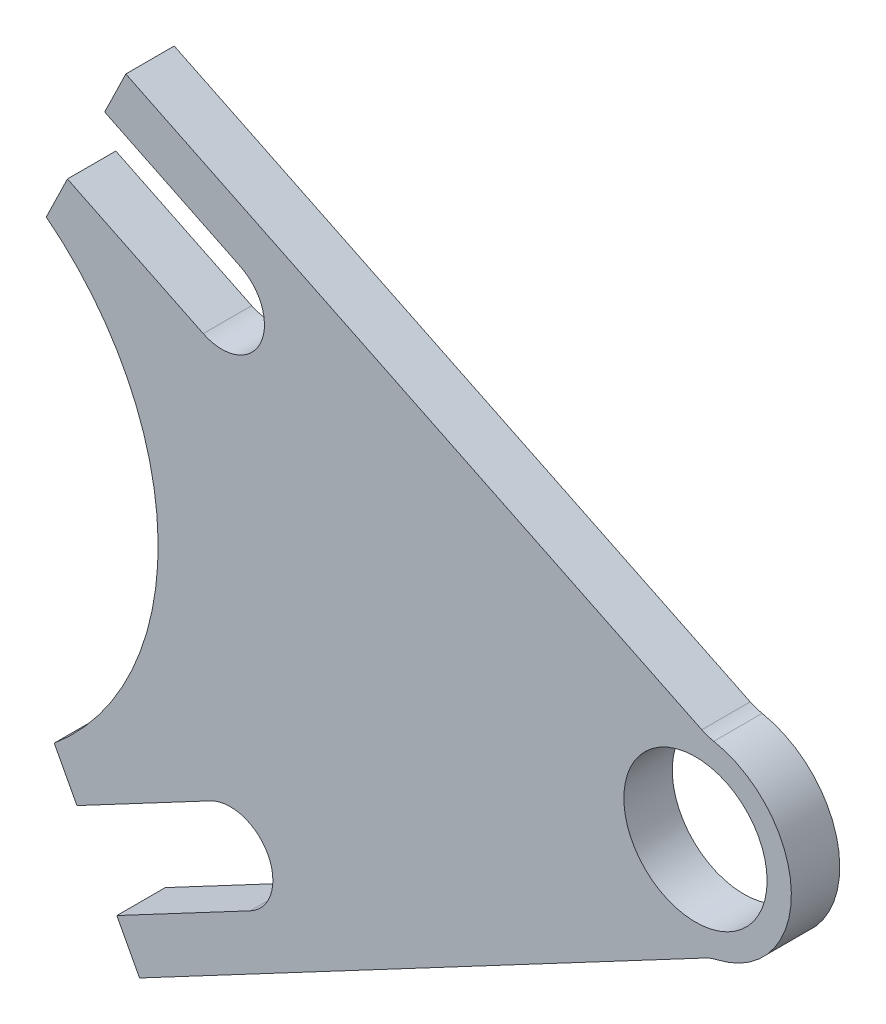
ISO-10303-21;
HEADER;
FILE_DESCRIPTION(('STEP AP214'),'2;1');
FILE_NAME('part.step','',(''),(''),'','','');
FILE_SCHEMA(('AUTOMOTIVE_DESIGN { 1 0 10303 214 1 1 1 1 }'));
ENDSEC;
DATA;
#1=APPLICATION_CONTEXT('core data for automotive mechanical design processes');
#2=APPLICATION_PROTOCOL_DEFINITION('international standard','automotive_design',2000,#1);
#3=PRODUCT_CONTEXT('',#1,'mechanical');
#4=PRODUCT('Part','Part','',(#3));
#5=PRODUCT_RELATED_PRODUCT_CATEGORY('part','',(#4));
#6=PRODUCT_DEFINITION_FORMATION('','',#4);
#7=PRODUCT_DEFINITION_CONTEXT('part definition',#1,'design');
#8=PRODUCT_DEFINITION('design','',#6,#7);
#9=PRODUCT_DEFINITION_SHAPE('','',#8);
#10=(LENGTH_UNIT() NAMED_UNIT(*) SI_UNIT(.MILLI.,.METRE.));
#11=(NAMED_UNIT(*) PLANE_ANGLE_UNIT() SI_UNIT($,.RADIAN.));
#12=(NAMED_UNIT(*) SI_UNIT($,.STERADIAN.) SOLID_ANGLE_UNIT());
#13=UNCERTAINTY_MEASURE_WITH_UNIT(LENGTH_MEASURE(1.E-05),#10,'distance_accuracy_value','');
#14=(GEOMETRIC_REPRESENTATION_CONTEXT(3) GLOBAL_UNCERTAINTY_ASSIGNED_CONTEXT((#13)) GLOBAL_UNIT_ASSIGNED_CONTEXT((#10,
#11,#12)) REPRESENTATION_CONTEXT('',''));
#15=CARTESIAN_POINT('',(0.,0.,0.));
#16=DIRECTION('',(0.,0.,1.));
#17=DIRECTION('',(1.,0.,0.));
#18=AXIS2_PLACEMENT_3D('',#15,#16,#17);
#19=CARTESIAN_POINT('',(140.884747940878,-265.526541750734,3.175));
#20=DIRECTION('',(-0.46869793001126,0.88335850615883,0.));
#21=DIRECTION('',(-0.88335850615883,-0.46869793001126,0.));
#22=AXIS2_PLACEMENT_3D('',#19,#20,#21);
#23=PLANE('',#22);
#24=DIRECTION('',(0.88335850615883,0.46869793001126,0.));
#25=VECTOR('',#24,1.);
#26=CARTESIAN_POINT('',(140.884747940878,-265.526541750734,-3.175));
#27=LINE('',#26,#25);
#28=CARTESIAN_POINT('',(555.481660500112,-45.5470958623932,-3.175));
#29=VERTEX_POINT('',#28);
#30=CARTESIAN_POINT('',(629.701094650699,-6.16728018115692,-3.175));
#31=VERTEX_POINT('',#30);
#32=EDGE_CURVE('E196',#29,#31,#27,.T.);
#33=ORIENTED_EDGE('',*,*,#32,.T.);
#34=DIRECTION('',(0.,0.,1.));
#35=VECTOR('',#34,1.);
#36=CARTESIAN_POINT('',(629.701094650699,-6.16728018115698,3.175));
#37=LINE('',#36,#35);
#38=CARTESIAN_POINT('',(629.701094650699,-6.16728018115692,3.175));
#39=VERTEX_POINT('',#38);
#40=EDGE_CURVE('E266',#31,#39,#37,.T.);
#41=ORIENTED_EDGE('',*,*,#40,.T.);
#42=DIRECTION('',(0.88335850615883,0.46869793001126,0.));
#43=VECTOR('',#42,1.);
#44=CARTESIAN_POINT('',(140.884747940878,-265.526541750734,3.175));
#45=LINE('',#44,#43);
#46=CARTESIAN_POINT('',(555.481660500112,-45.5470958623932,3.175));
#47=VERTEX_POINT('',#46);
#48=EDGE_CURVE('E230',#47,#39,#45,.T.);
#49=ORIENTED_EDGE('',*,*,#48,.F.);
#50=DIRECTION('',(0.,0.,-1.));
#51=VECTOR('',#50,1.);
#52=CARTESIAN_POINT('',(555.481660500112,-45.5470958623932,3.175));
#53=LINE('',#52,#51);
#54=EDGE_CURVE('E195',#47,#29,#53,.T.);
#55=ORIENTED_EDGE('',*,*,#54,.T.);
#56=EDGE_LOOP('',(#33,#41,#49,#55));
#57=FACE_BOUND('',#56,.T.);
#58=ADVANCED_FACE('F35',(#57),#23,.F.);
#59=CARTESIAN_POINT('',(628.416915809158,6.66568396213185,3.175));
#60=DIRECTION('',(0.,0.,-1.));
#61=DIRECTION('',(-1.,0.,0.));
#62=AXIS2_PLACEMENT_3D('',#59,#60,#61);
#63=CYLINDRICAL_SURFACE('',#62,12.578);
#64=CARTESIAN_POINT('',(628.416915809158,6.66568396213185,3.175));
#65=DIRECTION('',(0.,0.,1.));
#66=DIRECTION('',(1.,0.,0.));
#67=AXIS2_PLACEMENT_3D('',#64,#65,#66);
#68=CIRCLE('',#67,12.578);
#69=CARTESIAN_POINT('',(631.248036146662,-5.58955335236228,3.175));
#70=VERTEX_POINT('',#69);
#71=CARTESIAN_POINT('',(630.813307364924,19.0132906740194,3.175));
#72=VERTEX_POINT('',#71);
#73=EDGE_CURVE('E166',#70,#72,#68,.T.);
#74=ORIENTED_EDGE('',*,*,#73,.F.);
#75=DIRECTION('',(0.,0.,-1.));
#76=VECTOR('',#75,1.);
#77=CARTESIAN_POINT('',(631.248036146662,-5.58955335236228,3.175));
#78=LINE('',#77,#76);
#79=CARTESIAN_POINT('',(631.248036146662,-5.58955335236228,-3.175));
#80=VERTEX_POINT('',#79);
#81=EDGE_CURVE('E263',#70,#80,#78,.T.);
#82=ORIENTED_EDGE('',*,*,#81,.T.);
#83=CARTESIAN_POINT('',(628.416915809158,6.66568396213185,-3.175));
#84=DIRECTION('',(0.,0.,1.));
#85=DIRECTION('',(1.,0.,0.));
#86=AXIS2_PLACEMENT_3D('',#83,#84,#85);
#87=CIRCLE('',#86,12.578);
#88=CARTESIAN_POINT('',(630.813307364924,19.0132906740194,-3.175));
#89=VERTEX_POINT('',#88);
#90=EDGE_CURVE('E199',#80,#89,#87,.T.);
#91=ORIENTED_EDGE('',*,*,#90,.T.);
#92=DIRECTION('',(0.,0.,-1.));
#93=VECTOR('',#92,1.);
#94=CARTESIAN_POINT('',(630.813307364924,19.0132906740194,3.175));
#95=LINE('',#94,#93);
#96=EDGE_CURVE('E261',#89,#72,#95,.F.);
#97=ORIENTED_EDGE('',*,*,#96,.T.);
#98=EDGE_LOOP('',(#74,#82,#91,#97));
#99=FACE_BOUND('',#98,.T.);
#100=ADVANCED_FACE('F280',(#99),#63,.T.);
#101=CARTESIAN_POINT('',(127.956832082113,263.221954431705,3.175));
#102=DIRECTION('',(0.437197447541972,0.899365549630841,0.));
#103=DIRECTION('',(-0.899365549630841,0.437197447541972,0.));
#104=AXIS2_PLACEMENT_3D('',#101,#102,#103);
#105=PLANE('',#104);
#106=DIRECTION('',(0.899365549630841,-0.437197447541973,0.));
#107=VECTOR('',#106,1.);
#108=CARTESIAN_POINT('',(127.956832082113,263.221954431705,3.175));
#109=LINE('',#108,#107);
#110=CARTESIAN_POINT('',(553.682581575732,56.2691629801063,3.175));
#111=VERTEX_POINT('',#110);
#112=CARTESIAN_POINT('',(629.246921221238,19.5360054428066,3.175));
#113=VERTEX_POINT('',#112);
#114=EDGE_CURVE('E149',#111,#113,#109,.T.);
#115=ORIENTED_EDGE('',*,*,#114,.T.);
#116=DIRECTION('',(0.,0.,-1.));
#117=VECTOR('',#116,1.);
#118=CARTESIAN_POINT('',(629.246921221238,19.5360054428066,3.175));
#119=LINE('',#118,#117);
#120=CARTESIAN_POINT('',(629.246921221238,19.5360054428066,-3.175));
#121=VERTEX_POINT('',#120);
#122=EDGE_CURVE('E268',#113,#121,#119,.T.);
#123=ORIENTED_EDGE('',*,*,#122,.T.);
#124=DIRECTION('',(0.899365549630841,-0.437197447541973,0.));
#125=VECTOR('',#124,1.);
#126=CARTESIAN_POINT('',(127.956832082113,263.221954431705,-3.175));
#127=LINE('',#126,#125);
#128=CARTESIAN_POINT('',(553.682581575732,56.2691629801063,-3.175));
#129=VERTEX_POINT('',#128);
#130=EDGE_CURVE('E151',#129,#121,#127,.T.);
#131=ORIENTED_EDGE('',*,*,#130,.F.);
#132=DIRECTION('',(0.,0.,-1.));
#133=VECTOR('',#132,1.);
#134=CARTESIAN_POINT('',(553.682581575732,56.2691629801063,3.175));
#135=LINE('',#134,#133);
#136=EDGE_CURVE('E147',#111,#129,#135,.T.);
#137=ORIENTED_EDGE('',*,*,#136,.F.);
#138=EDGE_LOOP('',(#115,#123,#131,#137));
#139=FACE_BOUND('',#138,.T.);
#140=ADVANCED_FACE('F148',(#139),#105,.T.);
#141=CARTESIAN_POINT('',(425.725749493641,-206.952791451584,3.175));
#142=DIRECTION('',(-0.899365549630861,0.43719744754193,0.));
#143=DIRECTION('',(-0.43719744754193,-0.899365549630861,0.));
#144=AXIS2_PLACEMENT_3D('',#141,#142,#143);
#145=PLANE('',#144);
#146=DIRECTION('',(0.43719744754193,0.899365549630861,0.));
#147=VECTOR('',#146,1.);
#148=CARTESIAN_POINT('',(425.725749493641,-206.952791451584,-3.175));
#149=LINE('',#148,#147);
#150=CARTESIAN_POINT('',(550.906377783841,50.5581917399503,-3.175));
#151=VERTEX_POINT('',#150);
#152=EDGE_CURVE('E203',#151,#129,#149,.T.);
#153=ORIENTED_EDGE('',*,*,#152,.F.);
#154=DIRECTION('',(0.,0.,-1.));
#155=VECTOR('',#154,1.);
#156=CARTESIAN_POINT('',(550.906377783841,50.5581917399503,3.175));
#157=LINE('',#156,#155);
#158=CARTESIAN_POINT('',(550.906377783841,50.5581917399503,3.175));
#159=VERTEX_POINT('',#158);
#160=EDGE_CURVE('E157',#159,#151,#157,.T.);
#161=ORIENTED_EDGE('',*,*,#160,.F.);
#162=DIRECTION('',(0.43719744754193,0.899365549630861,0.));
#163=VECTOR('',#162,1.);
#164=CARTESIAN_POINT('',(425.725749493641,-206.952791451584,3.175));
#165=LINE('',#164,#163);
#166=EDGE_CURVE('E164',#159,#111,#165,.T.);
#167=ORIENTED_EDGE('',*,*,#166,.T.);
#168=ORIENTED_EDGE('',*,*,#136,.T.);
#169=EDGE_LOOP('',(#153,#161,#167,#168));
#170=FACE_BOUND('',#169,.T.);
#171=ADVANCED_FACE('F168',(#170),#145,.T.);
#172=CARTESIAN_POINT('',(125.180628290222,257.510983191549,3.175));
#173=DIRECTION('',(-0.437197447541973,-0.899365549630841,0.));
#174=DIRECTION('',(0.899365549630841,-0.437197447541973,0.));
#175=AXIS2_PLACEMENT_3D('',#172,#173,#174);
#176=PLANE('',#175);
#177=DIRECTION('',(-0.899365549630841,0.437197447541973,0.));
#178=VECTOR('',#177,1.);
#179=CARTESIAN_POINT('',(125.180628290222,257.510983191549,-3.175));
#180=LINE('',#179,#178);
#181=CARTESIAN_POINT('',(568.724608053127,41.8964359092488,-3.175));
#182=VERTEX_POINT('',#181);
#183=EDGE_CURVE('E205',#182,#151,#180,.T.);
#184=ORIENTED_EDGE('',*,*,#183,.F.);
#185=DIRECTION('',(0.,0.,-1.));
#186=VECTOR('',#185,1.);
#187=CARTESIAN_POINT('',(568.724608053127,41.8964359092488,3.175));
#188=LINE('',#187,#186);
#189=CARTESIAN_POINT('',(568.724608053127,41.8964359092488,3.175));
#190=VERTEX_POINT('',#189);
#191=EDGE_CURVE('E255',#190,#182,#188,.T.);
#192=ORIENTED_EDGE('',*,*,#191,.F.);
#193=DIRECTION('',(-0.899365549630841,0.437197447541973,0.));
#194=VECTOR('',#193,1.);
#195=CARTESIAN_POINT('',(125.180628290222,257.510983191549,3.175));
#196=LINE('',#195,#194);
#197=EDGE_CURVE('E169',#190,#159,#196,.T.);
#198=ORIENTED_EDGE('',*,*,#197,.T.);
#199=ORIENTED_EDGE('',*,*,#160,.T.);
#200=EDGE_LOOP('',(#184,#192,#198,#199));
#201=FACE_BOUND('',#200,.T.);
#202=ADVANCED_FACE('F348',(#201),#176,.T.);
#203=CARTESIAN_POINT('',(566.281548716262,36.8707812179115,3.175));
#204=DIRECTION('',(0.,0.,-1.));
#205=DIRECTION('',(-1.,0.,0.));
#206=AXIS2_PLACEMENT_3D('',#203,#204,#205);
#207=CYLINDRICAL_SURFACE('',#206,5.58799999999999);
#208=CARTESIAN_POINT('',(566.281548716262,36.8707812179115,-3.175));
#209=DIRECTION('',(0.,0.,1.));
#210=DIRECTION('',(1.,0.,0.));
#211=AXIS2_PLACEMENT_3D('',#208,#209,#210);
#212=CIRCLE('',#211,5.58799999999999);
#213=CARTESIAN_POINT('',(563.838489379398,31.8451265265747,-3.175));
#214=VERTEX_POINT('',#213);
#215=EDGE_CURVE('E208',#182,#214,#212,.F.);
#216=ORIENTED_EDGE('',*,*,#215,.T.);
#217=DIRECTION('',(0.,0.,-1.));
#218=VECTOR('',#217,1.);
#219=CARTESIAN_POINT('',(563.838489379398,31.8451265265747,3.175));
#220=LINE('',#219,#218);
#221=CARTESIAN_POINT('',(563.838489379398,31.8451265265747,3.175));
#222=VERTEX_POINT('',#221);
#223=EDGE_CURVE('E252',#222,#214,#220,.T.);
#224=ORIENTED_EDGE('',*,*,#223,.F.);
#225=CARTESIAN_POINT('',(566.281548716262,36.8707812179115,3.175));
#226=DIRECTION('',(0.,0.,1.));
#227=DIRECTION('',(1.,0.,0.));
#228=AXIS2_PLACEMENT_3D('',#225,#226,#227);
#229=CIRCLE('',#228,5.58799999999999);
#230=EDGE_CURVE('E171',#190,#222,#229,.F.);
#231=ORIENTED_EDGE('',*,*,#230,.F.);
#232=ORIENTED_EDGE('',*,*,#191,.T.);
#233=EDGE_LOOP('',(#216,#224,#231,#232));
#234=FACE_BOUND('',#233,.T.);
#235=ADVANCED_FACE('F350',(#234),#207,.F.);
#236=CARTESIAN_POINT('',(120.294509616494,247.459673808876,3.175));
#237=DIRECTION('',(-0.437197447541975,-0.899365549630839,0.));
#238=DIRECTION('',(0.899365549630839,-0.437197447541976,0.));
#239=AXIS2_PLACEMENT_3D('',#236,#237,#238);
#240=PLANE('',#239);
#241=DIRECTION('',(-0.899365549630839,0.437197447541976,0.));
#242=VECTOR('',#241,1.);
#243=CARTESIAN_POINT('',(120.294509616494,247.459673808876,-3.175));
#244=LINE('',#243,#242);
#245=CARTESIAN_POINT('',(546.020259110112,40.5068823572762,-3.175));
#246=VERTEX_POINT('',#245);
#247=EDGE_CURVE('E210',#214,#246,#244,.T.);
#248=ORIENTED_EDGE('',*,*,#247,.T.);
#249=DIRECTION('',(0.,0.,-1.));
#250=VECTOR('',#249,1.);
#251=CARTESIAN_POINT('',(546.020259110112,40.5068823572762,3.175));
#252=LINE('',#251,#250);
#253=CARTESIAN_POINT('',(546.020259110112,40.5068823572762,3.175));
#254=VERTEX_POINT('',#253);
#255=EDGE_CURVE('E249',#254,#246,#252,.T.);
#256=ORIENTED_EDGE('',*,*,#255,.F.);
#257=DIRECTION('',(-0.899365549630839,0.437197447541976,0.));
#258=VECTOR('',#257,1.);
#259=CARTESIAN_POINT('',(120.294509616494,247.459673808876,3.175));
#260=LINE('',#259,#258);
#261=EDGE_CURVE('E176',#222,#254,#260,.T.);
#262=ORIENTED_EDGE('',*,*,#261,.F.);
#263=ORIENTED_EDGE('',*,*,#223,.T.);
#264=EDGE_LOOP('',(#248,#256,#262,#263));
#265=FACE_BOUND('',#264,.T.);
#266=ADVANCED_FACE('F342',(#265),#240,.F.);
#267=CARTESIAN_POINT('',(425.725749493597,-206.952791451614,3.175));
#268=DIRECTION('',(0.899365549630819,-0.437197447542017,0.));
#269=DIRECTION('',(0.437197447542017,0.899365549630819,0.));
#270=AXIS2_PLACEMENT_3D('',#267,#268,#269);
#271=PLANE('',#270);
#272=DIRECTION('',(-0.437197447542017,-0.899365549630819,0.));
#273=VECTOR('',#272,1.);
#274=CARTESIAN_POINT('',(425.725749493597,-206.952791451614,-3.175));
#275=LINE('',#274,#273);
#276=CARTESIAN_POINT('',(543.24405531822,34.7959111171205,-3.175));
#277=VERTEX_POINT('',#276);
#278=EDGE_CURVE('E212',#246,#277,#275,.T.);
#279=ORIENTED_EDGE('',*,*,#278,.T.);
#280=DIRECTION('',(0.,0.,-1.));
#281=VECTOR('',#280,1.);
#282=CARTESIAN_POINT('',(543.24405531822,34.7959111171205,3.175));
#283=LINE('',#282,#281);
#284=CARTESIAN_POINT('',(543.24405531822,34.7959111171205,3.175));
#285=VERTEX_POINT('',#284);
#286=EDGE_CURVE('E246',#285,#277,#283,.T.);
#287=ORIENTED_EDGE('',*,*,#286,.F.);
#288=DIRECTION('',(-0.437197447542017,-0.899365549630819,0.));
#289=VECTOR('',#288,1.);
#290=CARTESIAN_POINT('',(425.725749493597,-206.952791451614,3.175));
#291=LINE('',#290,#289);
#292=EDGE_CURVE('E178',#254,#285,#291,.T.);
#293=ORIENTED_EDGE('',*,*,#292,.F.);
#294=ORIENTED_EDGE('',*,*,#255,.T.);
#295=EDGE_LOOP('',(#279,#287,#293,#294));
#296=FACE_BOUND('',#295,.T.);
#297=ADVANCED_FACE('F338',(#296),#271,.F.);
#298=CARTESIAN_POINT('',(414.596912559228,219.979445888345,3.175));
#299=DIRECTION('',(-0.883358506158824,-0.46869793001127,0.));
#300=DIRECTION('',(0.468697930011271,-0.883358506158825,0.));
#301=AXIS2_PLACEMENT_3D('',#298,#299,#300);
#302=PLANE('',#301);
#303=DIRECTION('',(-0.468697930011271,0.883358506158825,0.));
#304=VECTOR('',#303,1.);
#305=CARTESIAN_POINT('',(414.596912559228,219.979445888345,-3.175));
#306=LINE('',#305,#304);
#307=CARTESIAN_POINT('',(547.267260578735,-30.0653546834534,-3.175));
#308=VERTEX_POINT('',#307);
#309=CARTESIAN_POINT('',(544.291028723163,-24.456028169345,-3.175));
#310=VERTEX_POINT('',#309);
#311=EDGE_CURVE('E215',#308,#310,#306,.T.);
#312=ORIENTED_EDGE('',*,*,#311,.F.);
#313=DIRECTION('',(0.,0.,-1.));
#314=VECTOR('',#313,1.);
#315=CARTESIAN_POINT('',(547.267260578735,-30.0653546834534,3.175));
#316=LINE('',#315,#314);
#317=CARTESIAN_POINT('',(547.267260578735,-30.0653546834534,3.175));
#318=VERTEX_POINT('',#317);
#319=EDGE_CURVE('E241',#318,#308,#316,.T.);
#320=ORIENTED_EDGE('',*,*,#319,.F.);
#321=DIRECTION('',(-0.468697930011271,0.883358506158825,0.));
#322=VECTOR('',#321,1.);
#323=CARTESIAN_POINT('',(414.596912559228,219.979445888345,3.175));
#324=LINE('',#323,#322);
#325=CARTESIAN_POINT('',(544.291028723163,-24.456028169345,3.175));
#326=VERTEX_POINT('',#325);
#327=EDGE_CURVE('E180',#318,#326,#324,.T.);
#328=ORIENTED_EDGE('',*,*,#327,.T.);
#329=DIRECTION('',(0.,0.,-1.));
#330=VECTOR('',#329,1.);
#331=CARTESIAN_POINT('',(544.291028723163,-24.456028169345,3.175));
#332=LINE('',#331,#330);
#333=EDGE_CURVE('E243',#326,#310,#332,.T.);
#334=ORIENTED_EDGE('',*,*,#333,.T.);
#335=EDGE_LOOP('',(#312,#320,#328,#334));
#336=FACE_BOUND('',#335,.T.);
#337=ADVANCED_FACE('F312',(#336),#302,.T.);
#338=CARTESIAN_POINT('',(132.6703480195,-250.044800571794,3.175));
#339=DIRECTION('',(0.468697930011258,-0.883358506158831,0.));
#340=DIRECTION('',(0.883358506158831,0.468697930011258,0.));
#341=AXIS2_PLACEMENT_3D('',#338,#339,#340);
#342=PLANE('',#341);
#343=DIRECTION('',(-0.883358506158831,-0.468697930011258,0.));
#344=VECTOR('',#343,1.);
#345=CARTESIAN_POINT('',(132.6703480195,-250.044800571794,-3.175));
#346=LINE('',#345,#344);
#347=CARTESIAN_POINT('',(564.768359302754,-20.7795112940702,-3.175));
#348=VERTEX_POINT('',#347);
#349=EDGE_CURVE('E218',#348,#308,#346,.T.);
#350=ORIENTED_EDGE('',*,*,#349,.F.);
#351=DIRECTION('',(0.,0.,-1.));
#352=VECTOR('',#351,1.);
#353=CARTESIAN_POINT('',(564.768359302754,-20.7795112940702,3.175));
#354=LINE('',#353,#352);
#355=CARTESIAN_POINT('',(564.768359302754,-20.7795112940702,3.175));
#356=VERTEX_POINT('',#355);
#357=EDGE_CURVE('E239',#356,#348,#354,.T.);
#358=ORIENTED_EDGE('',*,*,#357,.F.);
#359=DIRECTION('',(-0.883358506158831,-0.468697930011258,0.));
#360=VECTOR('',#359,1.);
#361=CARTESIAN_POINT('',(132.6703480195,-250.044800571794,3.175));
#362=LINE('',#361,#360);
#363=EDGE_CURVE('E183',#356,#318,#362,.T.);
#364=ORIENTED_EDGE('',*,*,#363,.T.);
#365=ORIENTED_EDGE('',*,*,#319,.T.);
#366=EDGE_LOOP('',(#350,#358,#364,#365));
#367=FACE_BOUND('',#366,.T.);
#368=ADVANCED_FACE('F315',(#367),#342,.T.);
#369=CARTESIAN_POINT('',(567.387443335657,-25.7157186264859,3.175));
#370=DIRECTION('',(0.,0.,-1.));
#371=DIRECTION('',(-1.,0.,0.));
#372=AXIS2_PLACEMENT_3D('',#369,#370,#371);
#373=CYLINDRICAL_SURFACE('',#372,5.58800000000009);
#374=CARTESIAN_POINT('',(567.387443335657,-25.7157186264859,-3.175));
#375=DIRECTION('',(0.,0.,1.));
#376=DIRECTION('',(1.,0.,0.));
#377=AXIS2_PLACEMENT_3D('',#374,#375,#376);
#378=CIRCLE('',#377,5.58800000000009);
#379=CARTESIAN_POINT('',(570.00652736856,-30.6519259589014,-3.175));
#380=VERTEX_POINT('',#379);
#381=EDGE_CURVE('E221',#348,#380,#378,.F.);
#382=ORIENTED_EDGE('',*,*,#381,.T.);
#383=DIRECTION('',(0.,0.,-1.));
#384=VECTOR('',#383,1.);
#385=CARTESIAN_POINT('',(570.00652736856,-30.6519259589014,3.175));
#386=LINE('',#385,#384);
#387=CARTESIAN_POINT('',(570.00652736856,-30.6519259589014,3.175));
#388=VERTEX_POINT('',#387);
#389=EDGE_CURVE('E236',#388,#380,#386,.T.);
#390=ORIENTED_EDGE('',*,*,#389,.F.);
#391=CARTESIAN_POINT('',(567.387443335657,-25.7157186264859,3.175));
#392=DIRECTION('',(0.,0.,1.));
#393=DIRECTION('',(1.,0.,0.));
#394=AXIS2_PLACEMENT_3D('',#391,#392,#393);
#395=CIRCLE('',#394,5.58800000000009);
#396=EDGE_CURVE('E186',#356,#388,#395,.F.);
#397=ORIENTED_EDGE('',*,*,#396,.F.);
#398=ORIENTED_EDGE('',*,*,#357,.T.);
#399=EDGE_LOOP('',(#382,#390,#397,#398));
#400=FACE_BOUND('',#399,.T.);
#401=ADVANCED_FACE('F321',(#400),#373,.F.);
#402=CARTESIAN_POINT('',(137.908516085307,-259.917215236626,3.175));
#403=DIRECTION('',(0.46869793001126,-0.88335850615883,0.));
#404=DIRECTION('',(0.88335850615883,0.46869793001126,0.));
#405=AXIS2_PLACEMENT_3D('',#402,#403,#404);
#406=PLANE('',#405);
#407=DIRECTION('',(-0.88335850615883,-0.46869793001126,0.));
#408=VECTOR('',#407,1.);
#409=CARTESIAN_POINT('',(137.908516085307,-259.917215236626,-3.175));
#410=LINE('',#409,#408);
#411=CARTESIAN_POINT('',(552.505428644541,-39.9377693482846,-3.175));
#412=VERTEX_POINT('',#411);
#413=EDGE_CURVE('E223',#380,#412,#410,.T.);
#414=ORIENTED_EDGE('',*,*,#413,.T.);
#415=DIRECTION('',(0.,0.,-1.));
#416=VECTOR('',#415,1.);
#417=CARTESIAN_POINT('',(552.505428644541,-39.9377693482846,3.175));
#418=LINE('',#417,#416);
#419=CARTESIAN_POINT('',(552.505428644541,-39.9377693482846,3.175));
#420=VERTEX_POINT('',#419);
#421=EDGE_CURVE('E233',#420,#412,#418,.T.);
#422=ORIENTED_EDGE('',*,*,#421,.F.);
#423=DIRECTION('',(-0.88335850615883,-0.46869793001126,0.));
#424=VECTOR('',#423,1.);
#425=CARTESIAN_POINT('',(137.908516085307,-259.917215236626,3.175));
#426=LINE('',#425,#424);
#427=EDGE_CURVE('E188',#388,#420,#426,.T.);
#428=ORIENTED_EDGE('',*,*,#427,.F.);
#429=ORIENTED_EDGE('',*,*,#389,.T.);
#430=EDGE_LOOP('',(#414,#422,#428,#429));
#431=FACE_BOUND('',#430,.T.);
#432=ADVANCED_FACE('F325',(#431),#406,.F.);
#433=CARTESIAN_POINT('',(414.596912559238,219.979445888339,3.175));
#434=DIRECTION('',(0.883358506158834,0.468697930011253,0.));
#435=DIRECTION('',(-0.468697930011253,0.883358506158834,0.));
#436=AXIS2_PLACEMENT_3D('',#433,#434,#435);
#437=PLANE('',#436);
#438=DIRECTION('',(0.468697930011253,-0.883358506158834,0.));
#439=VECTOR('',#438,1.);
#440=CARTESIAN_POINT('',(414.596912559238,219.979445888339,-3.175));
#441=LINE('',#440,#439);
#442=EDGE_CURVE('E225',#412,#29,#441,.T.);
#443=ORIENTED_EDGE('',*,*,#442,.T.);
#444=ORIENTED_EDGE('',*,*,#54,.F.);
#445=DIRECTION('',(0.468697930011253,-0.883358506158834,0.));
#446=VECTOR('',#445,1.);
#447=CARTESIAN_POINT('',(414.596912559238,219.979445888339,3.175));
#448=LINE('',#447,#446);
#449=EDGE_CURVE('E190',#420,#47,#448,.T.);
#450=ORIENTED_EDGE('',*,*,#449,.F.);
#451=ORIENTED_EDGE('',*,*,#421,.T.);
#452=EDGE_LOOP('',(#443,#444,#450,#451));
#453=FACE_BOUND('',#452,.T.);
#454=ADVANCED_FACE('F330',(#453),#437,.F.);
#455=CARTESIAN_POINT('',(628.416915809158,6.66568396213185,3.175));
#456=DIRECTION('',(0.,0.,-1.));
#457=DIRECTION('',(-1.,0.,0.));
#458=AXIS2_PLACEMENT_3D('',#455,#456,#457);
#459=CYLINDRICAL_SURFACE('',#458,9.39800000000006);
#460=CARTESIAN_POINT('',(628.416915809158,6.66568396213185,3.175));
#461=DIRECTION('',(0.,0.,1.));
#462=DIRECTION('',(1.,0.,0.));
#463=AXIS2_PLACEMENT_3D('',#460,#461,#462);
#464=CIRCLE('',#463,9.39800000000006);
#465=CARTESIAN_POINT('',(637.814915809158,6.66568396213185,3.175));
#466=VERTEX_POINT('',#465);
#467=EDGE_CURVE('E192',#466,#466,#464,.T.);
#468=ORIENTED_EDGE('',*,*,#467,.T.);
#469=EDGE_LOOP('',(#468));
#470=FACE_BOUND('',#469,.T.);
#471=CARTESIAN_POINT('',(628.416915809158,6.66568396213185,-3.175));
#472=DIRECTION('',(0.,0.,1.));
#473=DIRECTION('',(1.,0.,0.));
#474=AXIS2_PLACEMENT_3D('',#471,#472,#473);
#475=CIRCLE('',#474,9.39800000000006);
#476=CARTESIAN_POINT('',(637.814915809158,6.66568396213185,-3.175));
#477=VERTEX_POINT('',#476);
#478=EDGE_CURVE('E227',#477,#477,#475,.T.);
#479=ORIENTED_EDGE('',*,*,#478,.F.);
#480=EDGE_LOOP('',(#479));
#481=FACE_BOUND('',#480,.T.);
#482=ADVANCED_FACE('F423',(#470,#481),#459,.F.);
#483=CARTESIAN_POINT('',(0.,0.,3.175));
#484=DIRECTION('',(0.,0.,1.));
#485=DIRECTION('',(1.,0.,0.));
#486=AXIS2_PLACEMENT_3D('',#483,#484,#485);
#487=PLANE('',#486);
#488=ORIENTED_EDGE('',*,*,#48,.T.);
#489=CARTESIAN_POINT('',(632.677326506271,-11.7766066952655,3.175));
#490=DIRECTION('',(0.,0.,1.));
#491=DIRECTION('',(1.,0.,0.));
#492=AXIS2_PLACEMENT_3D('',#489,#490,#491);
#493=CIRCLE('',#492,6.35);
#494=EDGE_CURVE('E272',#39,#70,#493,.F.);
#495=ORIENTED_EDGE('',*,*,#494,.T.);
#496=ORIENTED_EDGE('',*,*,#73,.T.);
#497=CARTESIAN_POINT('',(632.023125013129,25.2469766829625,3.175));
#498=DIRECTION('',(0.,0.,1.));
#499=DIRECTION('',(1.,0.,0.));
#500=AXIS2_PLACEMENT_3D('',#497,#498,#499);
#501=CIRCLE('',#500,6.35);
#502=EDGE_CURVE('E11',#72,#113,#501,.F.);
#503=ORIENTED_EDGE('',*,*,#502,.T.);
#504=ORIENTED_EDGE('',*,*,#114,.F.);
#505=ORIENTED_EDGE('',*,*,#166,.F.);
#506=ORIENTED_EDGE('',*,*,#197,.F.);
#507=ORIENTED_EDGE('',*,*,#230,.T.);
#508=ORIENTED_EDGE('',*,*,#261,.T.);
#509=ORIENTED_EDGE('',*,*,#292,.T.);
#510=CARTESIAN_POINT('',(519.820541440057,4.74680135327721,3.175));
#511=DIRECTION('',(0.,0.,1.));
#512=DIRECTION('',(1.,0.,0.));
#513=AXIS2_PLACEMENT_3D('',#510,#511,#512);
#514=CIRCLE('',#513,38.1);
#515=EDGE_CURVE('E259',#285,#326,#514,.F.);
#516=ORIENTED_EDGE('',*,*,#515,.T.);
#517=ORIENTED_EDGE('',*,*,#327,.F.);
#518=ORIENTED_EDGE('',*,*,#363,.F.);
#519=ORIENTED_EDGE('',*,*,#396,.T.);
#520=ORIENTED_EDGE('',*,*,#427,.T.);
#521=ORIENTED_EDGE('',*,*,#449,.T.);
#522=EDGE_LOOP('',(#488,#495,#496,#503,#504,#505,#506,#507,#508,#509,#516,#517,#518,#519,#520,#521));
#523=FACE_BOUND('',#522,.T.);
#524=ORIENTED_EDGE('',*,*,#467,.F.);
#525=EDGE_LOOP('',(#524));
#526=FACE_BOUND('',#525,.T.);
#527=ADVANCED_FACE('F161',(#523,#526),#487,.T.);
#528=CARTESIAN_POINT('',(0.,0.,-3.175));
#529=DIRECTION('',(0.,0.,1.));
#530=DIRECTION('',(1.,0.,0.));
#531=AXIS2_PLACEMENT_3D('',#528,#529,#530);
#532=PLANE('',#531);
#533=ORIENTED_EDGE('',*,*,#32,.F.);
#534=ORIENTED_EDGE('',*,*,#442,.F.);
#535=ORIENTED_EDGE('',*,*,#413,.F.);
#536=ORIENTED_EDGE('',*,*,#381,.F.);
#537=ORIENTED_EDGE('',*,*,#349,.T.);
#538=ORIENTED_EDGE('',*,*,#311,.T.);
#539=CARTESIAN_POINT('',(519.820541440057,4.74680135327721,-3.175));
#540=DIRECTION('',(0.,0.,1.));
#541=DIRECTION('',(1.,0.,0.));
#542=AXIS2_PLACEMENT_3D('',#539,#540,#541);
#543=CIRCLE('',#542,38.1);
#544=EDGE_CURVE('E156',#310,#277,#543,.T.);
#545=ORIENTED_EDGE('',*,*,#544,.T.);
#546=ORIENTED_EDGE('',*,*,#278,.F.);
#547=ORIENTED_EDGE('',*,*,#247,.F.);
#548=ORIENTED_EDGE('',*,*,#215,.F.);
#549=ORIENTED_EDGE('',*,*,#183,.T.);
#550=ORIENTED_EDGE('',*,*,#152,.T.);
#551=ORIENTED_EDGE('',*,*,#130,.T.);
#552=CARTESIAN_POINT('',(632.023125013129,25.2469766829625,-3.175));
#553=DIRECTION('',(0.,0.,1.));
#554=DIRECTION('',(1.,0.,0.));
#555=AXIS2_PLACEMENT_3D('',#552,#553,#554);
#556=CIRCLE('',#555,6.35);
#557=EDGE_CURVE('E43',#121,#89,#556,.T.);
#558=ORIENTED_EDGE('',*,*,#557,.T.);
#559=ORIENTED_EDGE('',*,*,#90,.F.);
#560=CARTESIAN_POINT('',(632.677326506271,-11.7766066952655,-3.175));
#561=DIRECTION('',(0.,0.,1.));
#562=DIRECTION('',(1.,0.,0.));
#563=AXIS2_PLACEMENT_3D('',#560,#561,#562);
#564=CIRCLE('',#563,6.35);
#565=EDGE_CURVE('E270',#80,#31,#564,.T.);
#566=ORIENTED_EDGE('',*,*,#565,.T.);
#567=EDGE_LOOP('',(#533,#534,#535,#536,#537,#538,#545,#546,#547,#548,#549,#550,#551,#558,#559,#566));
#568=FACE_BOUND('',#567,.T.);
#569=ORIENTED_EDGE('',*,*,#478,.T.);
#570=EDGE_LOOP('',(#569));
#571=FACE_BOUND('',#570,.T.);
#572=ADVANCED_FACE('F276',(#568,#571),#532,.F.);
#573=CARTESIAN_POINT('',(519.820541440057,4.74680135327721,3.175));
#574=DIRECTION('',(0.,0.,1.));
#575=DIRECTION('',(1.,0.,0.));
#576=AXIS2_PLACEMENT_3D('',#573,#574,#575);
#577=CYLINDRICAL_SURFACE('',#576,38.1);
#578=ORIENTED_EDGE('',*,*,#515,.F.);
#579=ORIENTED_EDGE('',*,*,#286,.T.);
#580=ORIENTED_EDGE('',*,*,#544,.F.);
#581=ORIENTED_EDGE('',*,*,#333,.F.);
#582=EDGE_LOOP('',(#578,#579,#580,#581));
#583=FACE_BOUND('',#582,.T.);
#584=ADVANCED_FACE('F287',(#583),#577,.F.);
#585=CARTESIAN_POINT('',(632.677326506271,-11.7766066952655,3.175));
#586=DIRECTION('',(0.,0.,-1.));
#587=DIRECTION('',(-1.,0.,0.));
#588=AXIS2_PLACEMENT_3D('',#585,#586,#587);
#589=CYLINDRICAL_SURFACE('',#588,6.35);
#590=ORIENTED_EDGE('',*,*,#494,.F.);
#591=ORIENTED_EDGE('',*,*,#40,.F.);
#592=ORIENTED_EDGE('',*,*,#565,.F.);
#593=ORIENTED_EDGE('',*,*,#81,.F.);
#594=EDGE_LOOP('',(#590,#591,#592,#593));
#595=FACE_BOUND('',#594,.T.);
#596=ADVANCED_FACE('F283',(#595),#589,.F.);
#597=CARTESIAN_POINT('',(632.023125013129,25.2469766829625,3.175));
#598=DIRECTION('',(0.,0.,-1.));
#599=DIRECTION('',(-1.,0.,0.));
#600=AXIS2_PLACEMENT_3D('',#597,#598,#599);
#601=CYLINDRICAL_SURFACE('',#600,6.35);
#602=ORIENTED_EDGE('',*,*,#502,.F.);
#603=ORIENTED_EDGE('',*,*,#96,.F.);
#604=ORIENTED_EDGE('',*,*,#557,.F.);
#605=ORIENTED_EDGE('',*,*,#122,.F.);
#606=EDGE_LOOP('',(#602,#603,#604,#605));
#607=FACE_BOUND('',#606,.T.);
#608=ADVANCED_FACE('F37',(#607),#601,.F.);
#609=CLOSED_SHELL('',(#58,#100,#140,#171,#202,#235,#266,#297,#337,#368,#401,#432,#454,#482,#527,
#572,#584,#596,#608));
#610=MANIFOLD_SOLID_BREP('B2',#609);
#611=ADVANCED_BREP_SHAPE_REPRESENTATION('',(#18,#610),#14);
#612=SHAPE_DEFINITION_REPRESENTATION(#9,#611);
ENDSEC;
END-ISO-10303-21;
